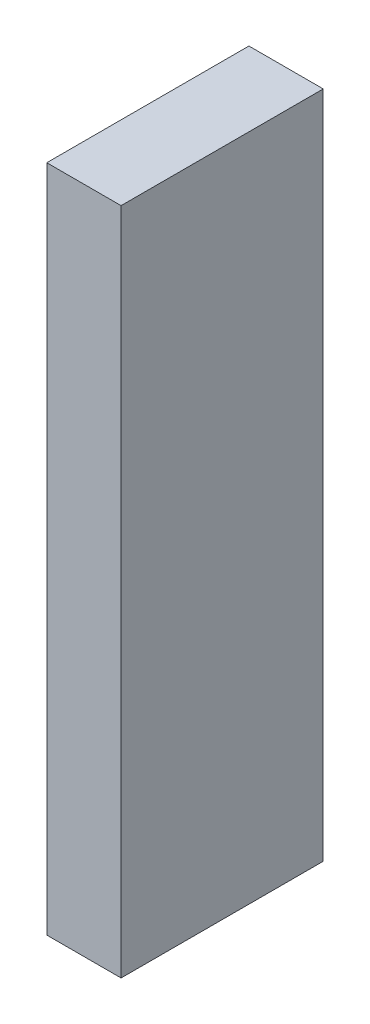
ISO-10303-21;
HEADER;
FILE_DESCRIPTION(('STEP AP214'),'2;1');
FILE_NAME('part.step','',(''),(''),'','','');
FILE_SCHEMA(('AUTOMOTIVE_DESIGN { 1 0 10303 214 1 1 1 1 }'));
ENDSEC;
DATA;
#1=APPLICATION_CONTEXT('core data for automotive mechanical design processes');
#2=APPLICATION_PROTOCOL_DEFINITION('international standard','automotive_design',2000,#1);
#3=PRODUCT_CONTEXT('',#1,'mechanical');
#4=PRODUCT('Part','Part','',(#3));
#5=PRODUCT_RELATED_PRODUCT_CATEGORY('part','',(#4));
#6=PRODUCT_DEFINITION_FORMATION('','',#4);
#7=PRODUCT_DEFINITION_CONTEXT('part definition',#1,'design');
#8=PRODUCT_DEFINITION('design','',#6,#7);
#9=PRODUCT_DEFINITION_SHAPE('','',#8);
#10=(LENGTH_UNIT() NAMED_UNIT(*) SI_UNIT(.MILLI.,.METRE.));
#11=(NAMED_UNIT(*) PLANE_ANGLE_UNIT() SI_UNIT($,.RADIAN.));
#12=(NAMED_UNIT(*) SI_UNIT($,.STERADIAN.) SOLID_ANGLE_UNIT());
#13=UNCERTAINTY_MEASURE_WITH_UNIT(LENGTH_MEASURE(1.E-05),#10,'distance_accuracy_value','');
#14=(GEOMETRIC_REPRESENTATION_CONTEXT(3) GLOBAL_UNCERTAINTY_ASSIGNED_CONTEXT((#13)) GLOBAL_UNIT_ASSIGNED_CONTEXT((#10,
#11,#12)) REPRESENTATION_CONTEXT('',''));
#15=CARTESIAN_POINT('',(0.,0.,0.));
#16=DIRECTION('',(0.,0.,1.));
#17=DIRECTION('',(1.,0.,0.));
#18=AXIS2_PLACEMENT_3D('',#15,#16,#17);
#19=CARTESIAN_POINT('',(3.175,-14.2875,-4.318));
#20=DIRECTION('',(0.,0.,1.));
#21=DIRECTION('',(1.,0.,0.));
#22=AXIS2_PLACEMENT_3D('',#19,#20,#21);
#23=PLANE('',#22);
#24=DIRECTION('',(0.,1.,0.));
#25=VECTOR('',#24,1.);
#26=CARTESIAN_POINT('',(0.,-14.2875,-4.318));
#27=LINE('',#26,#25);
#28=CARTESIAN_POINT('',(0.,-14.2875,-4.318));
#29=VERTEX_POINT('',#28);
#30=CARTESIAN_POINT('',(0.,14.2875,-4.318));
#31=VERTEX_POINT('',#30);
#32=EDGE_CURVE('E96',#29,#31,#27,.T.);
#33=ORIENTED_EDGE('',*,*,#32,.T.);
#34=DIRECTION('',(-1.,0.,0.));
#35=VECTOR('',#34,1.);
#36=CARTESIAN_POINT('',(3.175,14.2875,-4.318));
#37=LINE('',#36,#35);
#38=CARTESIAN_POINT('',(3.175,14.2875,-4.318));
#39=VERTEX_POINT('',#38);
#40=EDGE_CURVE('E11',#39,#31,#37,.T.);
#41=ORIENTED_EDGE('',*,*,#40,.F.);
#42=DIRECTION('',(0.,1.,0.));
#43=VECTOR('',#42,1.);
#44=CARTESIAN_POINT('',(3.175,-14.2875,-4.318));
#45=LINE('',#44,#43);
#46=CARTESIAN_POINT('',(3.175,-14.2875,-4.318));
#47=VERTEX_POINT('',#46);
#48=EDGE_CURVE('E84',#47,#39,#45,.T.);
#49=ORIENTED_EDGE('',*,*,#48,.F.);
#50=DIRECTION('',(-1.,0.,0.));
#51=VECTOR('',#50,1.);
#52=CARTESIAN_POINT('',(3.175,-14.2875,-4.318));
#53=LINE('',#52,#51);
#54=EDGE_CURVE('E92',#47,#29,#53,.T.);
#55=ORIENTED_EDGE('',*,*,#54,.T.);
#56=EDGE_LOOP('',(#33,#41,#49,#55));
#57=FACE_BOUND('',#56,.T.);
#58=ADVANCED_FACE('F33',(#57),#23,.F.);
#59=CARTESIAN_POINT('',(3.175,14.2875,4.318));
#60=DIRECTION('',(0.,-1.,0.));
#61=DIRECTION('',(0.,0.,-1.));
#62=AXIS2_PLACEMENT_3D('',#59,#60,#61);
#63=PLANE('',#62);
#64=DIRECTION('',(0.,0.,1.));
#65=VECTOR('',#64,1.);
#66=CARTESIAN_POINT('',(0.,14.2875,4.318));
#67=LINE('',#66,#65);
#68=CARTESIAN_POINT('',(0.,14.2875,4.318));
#69=VERTEX_POINT('',#68);
#70=EDGE_CURVE('E88',#31,#69,#67,.T.);
#71=ORIENTED_EDGE('',*,*,#70,.T.);
#72=DIRECTION('',(-1.,0.,0.));
#73=VECTOR('',#72,1.);
#74=CARTESIAN_POINT('',(3.175,14.2875,4.318));
#75=LINE('',#74,#73);
#76=CARTESIAN_POINT('',(3.175,14.2875,4.318));
#77=VERTEX_POINT('',#76);
#78=EDGE_CURVE('E41',#77,#69,#75,.T.);
#79=ORIENTED_EDGE('',*,*,#78,.F.);
#80=DIRECTION('',(0.,0.,1.));
#81=VECTOR('',#80,1.);
#82=CARTESIAN_POINT('',(3.175,14.2875,4.318));
#83=LINE('',#82,#81);
#84=EDGE_CURVE('E79',#39,#77,#83,.T.);
#85=ORIENTED_EDGE('',*,*,#84,.F.);
#86=ORIENTED_EDGE('',*,*,#40,.T.);
#87=EDGE_LOOP('',(#71,#79,#85,#86));
#88=FACE_BOUND('',#87,.T.);
#89=ADVANCED_FACE('F87',(#88),#63,.F.);
#90=CARTESIAN_POINT('',(3.175,-14.2875,4.318));
#91=DIRECTION('',(0.,0.,-1.));
#92=DIRECTION('',(-1.,0.,0.));
#93=AXIS2_PLACEMENT_3D('',#90,#91,#92);
#94=PLANE('',#93);
#95=DIRECTION('',(0.,-1.,0.));
#96=VECTOR('',#95,1.);
#97=CARTESIAN_POINT('',(0.,-14.2875,4.318));
#98=LINE('',#97,#96);
#99=CARTESIAN_POINT('',(0.,-14.2875,4.318));
#100=VERTEX_POINT('',#99);
#101=EDGE_CURVE('E66',#69,#100,#98,.T.);
#102=ORIENTED_EDGE('',*,*,#101,.T.);
#103=DIRECTION('',(-1.,0.,0.));
#104=VECTOR('',#103,1.);
#105=CARTESIAN_POINT('',(3.175,-14.2875,4.318));
#106=LINE('',#105,#104);
#107=CARTESIAN_POINT('',(3.175,-14.2875,4.318));
#108=VERTEX_POINT('',#107);
#109=EDGE_CURVE('E89',#108,#100,#106,.T.);
#110=ORIENTED_EDGE('',*,*,#109,.F.);
#111=DIRECTION('',(0.,-1.,0.));
#112=VECTOR('',#111,1.);
#113=CARTESIAN_POINT('',(3.175,-14.2875,4.318));
#114=LINE('',#113,#112);
#115=EDGE_CURVE('E82',#77,#108,#114,.T.);
#116=ORIENTED_EDGE('',*,*,#115,.F.);
#117=ORIENTED_EDGE('',*,*,#78,.T.);
#118=EDGE_LOOP('',(#102,#110,#116,#117));
#119=FACE_BOUND('',#118,.T.);
#120=ADVANCED_FACE('F90',(#119),#94,.F.);
#121=CARTESIAN_POINT('',(3.175,-14.2875,4.318));
#122=DIRECTION('',(0.,1.,0.));
#123=DIRECTION('',(0.,0.,1.));
#124=AXIS2_PLACEMENT_3D('',#121,#122,#123);
#125=PLANE('',#124);
#126=DIRECTION('',(0.,0.,-1.));
#127=VECTOR('',#126,1.);
#128=CARTESIAN_POINT('',(0.,-14.2875,4.318));
#129=LINE('',#128,#127);
#130=EDGE_CURVE('E72',#100,#29,#129,.T.);
#131=ORIENTED_EDGE('',*,*,#130,.T.);
#132=ORIENTED_EDGE('',*,*,#54,.F.);
#133=DIRECTION('',(0.,0.,-1.));
#134=VECTOR('',#133,1.);
#135=CARTESIAN_POINT('',(3.175,-14.2875,4.318));
#136=LINE('',#135,#134);
#137=EDGE_CURVE('E49',#108,#47,#136,.T.);
#138=ORIENTED_EDGE('',*,*,#137,.F.);
#139=ORIENTED_EDGE('',*,*,#109,.T.);
#140=EDGE_LOOP('',(#131,#132,#138,#139));
#141=FACE_BOUND('',#140,.T.);
#142=ADVANCED_FACE('F103',(#141),#125,.F.);
#143=CARTESIAN_POINT('',(3.175,14.2875,-4.318));
#144=DIRECTION('',(-1.,0.,0.));
#145=DIRECTION('',(0.,0.,1.));
#146=AXIS2_PLACEMENT_3D('',#143,#144,#145);
#147=PLANE('',#146);
#148=ORIENTED_EDGE('',*,*,#48,.T.);
#149=ORIENTED_EDGE('',*,*,#84,.T.);
#150=ORIENTED_EDGE('',*,*,#115,.T.);
#151=ORIENTED_EDGE('',*,*,#137,.T.);
#152=EDGE_LOOP('',(#148,#149,#150,#151));
#153=FACE_BOUND('',#152,.T.);
#154=ADVANCED_FACE('F80',(#153),#147,.F.);
#155=CARTESIAN_POINT('',(0.,14.2875,-4.318));
#156=DIRECTION('',(-1.,0.,0.));
#157=DIRECTION('',(0.,0.,1.));
#158=AXIS2_PLACEMENT_3D('',#155,#156,#157);
#159=PLANE('',#158);
#160=ORIENTED_EDGE('',*,*,#32,.F.);
#161=ORIENTED_EDGE('',*,*,#130,.F.);
#162=ORIENTED_EDGE('',*,*,#101,.F.);
#163=ORIENTED_EDGE('',*,*,#70,.F.);
#164=EDGE_LOOP('',(#160,#161,#162,#163));
#165=FACE_BOUND('',#164,.T.);
#166=ADVANCED_FACE('F106',(#165),#159,.T.);
#167=CLOSED_SHELL('',(#58,#89,#120,#142,#154,#166));
#168=MANIFOLD_SOLID_BREP('B2',#167);
#169=ADVANCED_BREP_SHAPE_REPRESENTATION('',(#18,#168),#14);
#170=SHAPE_DEFINITION_REPRESENTATION(#9,#169);
ENDSEC;
END-ISO-10303-21;
